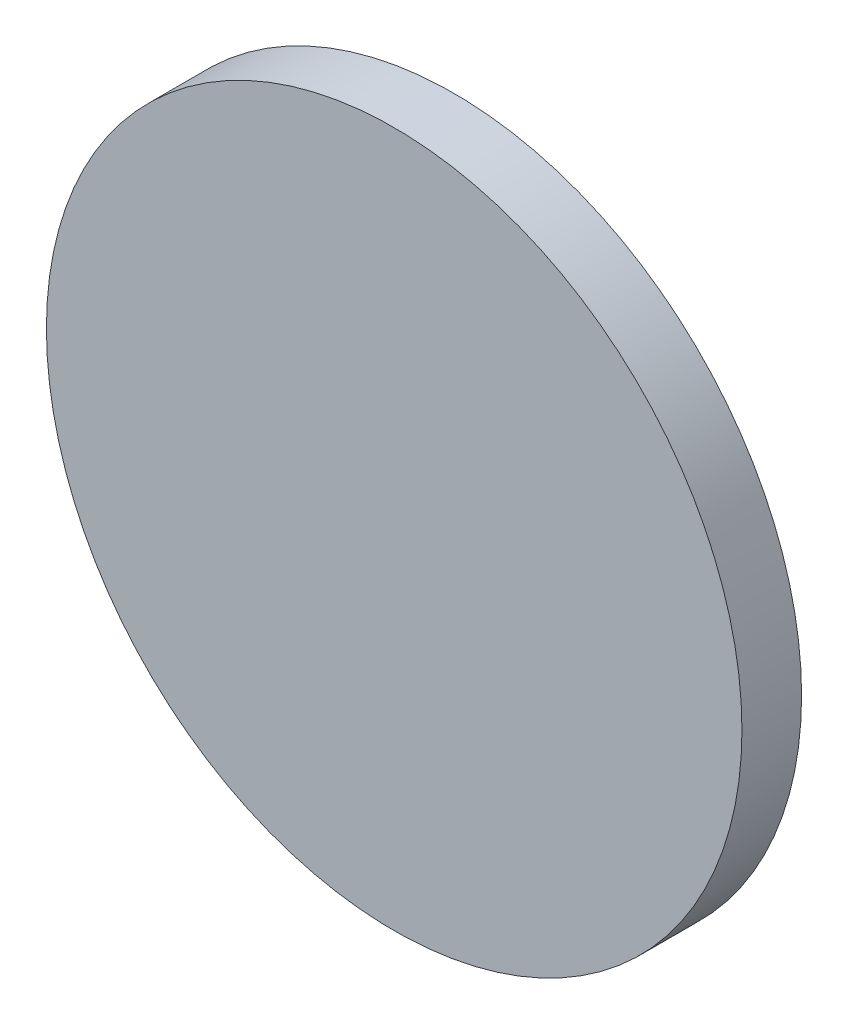
ISO-10303-21;
HEADER;
FILE_DESCRIPTION(('STEP AP214'),'2;1');
FILE_NAME('part.step','',(''),(''),'','','');
FILE_SCHEMA(('AUTOMOTIVE_DESIGN { 1 0 10303 214 1 1 1 1 }'));
ENDSEC;
DATA;
#1=APPLICATION_CONTEXT('core data for automotive mechanical design processes');
#2=APPLICATION_PROTOCOL_DEFINITION('international standard','automotive_design',2000,#1);
#3=PRODUCT_CONTEXT('',#1,'mechanical');
#4=PRODUCT('Part','Part','',(#3));
#5=PRODUCT_RELATED_PRODUCT_CATEGORY('part','',(#4));
#6=PRODUCT_DEFINITION_FORMATION('','',#4);
#7=PRODUCT_DEFINITION_CONTEXT('part definition',#1,'design');
#8=PRODUCT_DEFINITION('design','',#6,#7);
#9=PRODUCT_DEFINITION_SHAPE('','',#8);
#10=(LENGTH_UNIT() NAMED_UNIT(*) SI_UNIT(.MILLI.,.METRE.));
#11=(NAMED_UNIT(*) PLANE_ANGLE_UNIT() SI_UNIT($,.RADIAN.));
#12=(NAMED_UNIT(*) SI_UNIT($,.STERADIAN.) SOLID_ANGLE_UNIT());
#13=UNCERTAINTY_MEASURE_WITH_UNIT(LENGTH_MEASURE(1.E-05),#10,'distance_accuracy_value','');
#14=(GEOMETRIC_REPRESENTATION_CONTEXT(3) GLOBAL_UNCERTAINTY_ASSIGNED_CONTEXT((#13)) GLOBAL_UNIT_ASSIGNED_CONTEXT((#10,
#11,#12)) REPRESENTATION_CONTEXT('',''));
#15=CARTESIAN_POINT('',(0.,0.,0.));
#16=DIRECTION('',(0.,0.,1.));
#17=DIRECTION('',(1.,0.,0.));
#18=AXIS2_PLACEMENT_3D('',#15,#16,#17);
#19=CARTESIAN_POINT('',(3.33248,2.773680006176,0.));
#20=DIRECTION('',(0.,0.,-1.));
#21=DIRECTION('',(-1.,0.,0.));
#22=AXIS2_PLACEMENT_3D('',#19,#20,#21);
#23=PLANE('',#22);
#24=CARTESIAN_POINT('',(3.33248,2.773680006176,0.));
#25=DIRECTION('',(0.,0.,1.));
#26=DIRECTION('',(1.,0.,0.));
#27=AXIS2_PLACEMENT_3D('',#24,#25,#26);
#28=CIRCLE('',#27,0.200024667);
#29=CARTESIAN_POINT('',(3.532504667,2.773680006176,0.));
#30=VERTEX_POINT('',#29);
#31=EDGE_CURVE('E18',#30,#30,#28,.T.);
#32=ORIENTED_EDGE('',*,*,#31,.F.);
#33=EDGE_LOOP('',(#32));
#34=FACE_BOUND('',#33,.T.);
#35=ADVANCED_FACE('F15',(#34),#23,.T.);
#36=CARTESIAN_POINT('',(3.33248,2.773680006176,0.));
#37=DIRECTION('',(0.,0.,1.));
#38=DIRECTION('',(1.,0.,0.));
#39=AXIS2_PLACEMENT_3D('',#36,#37,#38);
#40=CYLINDRICAL_SURFACE('',#39,0.200024667);
#41=CARTESIAN_POINT('',(3.33248,2.773680006176,0.03429));
#42=DIRECTION('',(0.,0.,1.));
#43=DIRECTION('',(1.,0.,0.));
#44=AXIS2_PLACEMENT_3D('',#41,#42,#43);
#45=CIRCLE('',#44,0.200024667);
#46=CARTESIAN_POINT('',(3.532504667,2.773680006176,0.03429));
#47=VERTEX_POINT('',#46);
#48=EDGE_CURVE('E10',#47,#47,#45,.T.);
#49=ORIENTED_EDGE('',*,*,#48,.F.);
#50=EDGE_LOOP('',(#49));
#51=FACE_BOUND('',#50,.T.);
#52=ORIENTED_EDGE('',*,*,#31,.T.);
#53=EDGE_LOOP('',(#52));
#54=FACE_BOUND('',#53,.T.);
#55=ADVANCED_FACE('F27',(#51,#54),#40,.T.);
#56=CARTESIAN_POINT('',(3.33248,2.773680006176,0.03429));
#57=DIRECTION('',(0.,0.,1.));
#58=DIRECTION('',(1.,0.,0.));
#59=AXIS2_PLACEMENT_3D('',#56,#57,#58);
#60=PLANE('',#59);
#61=ORIENTED_EDGE('',*,*,#48,.T.);
#62=EDGE_LOOP('',(#61));
#63=FACE_BOUND('',#62,.T.);
#64=ADVANCED_FACE('F34',(#63),#60,.T.);
#65=CLOSED_SHELL('',(#35,#55,#64));
#66=MANIFOLD_SOLID_BREP('B1',#65);
#67=ADVANCED_BREP_SHAPE_REPRESENTATION('',(#18,#66),#14);
#68=SHAPE_DEFINITION_REPRESENTATION(#9,#67);
ENDSEC;
END-ISO-10303-21;
